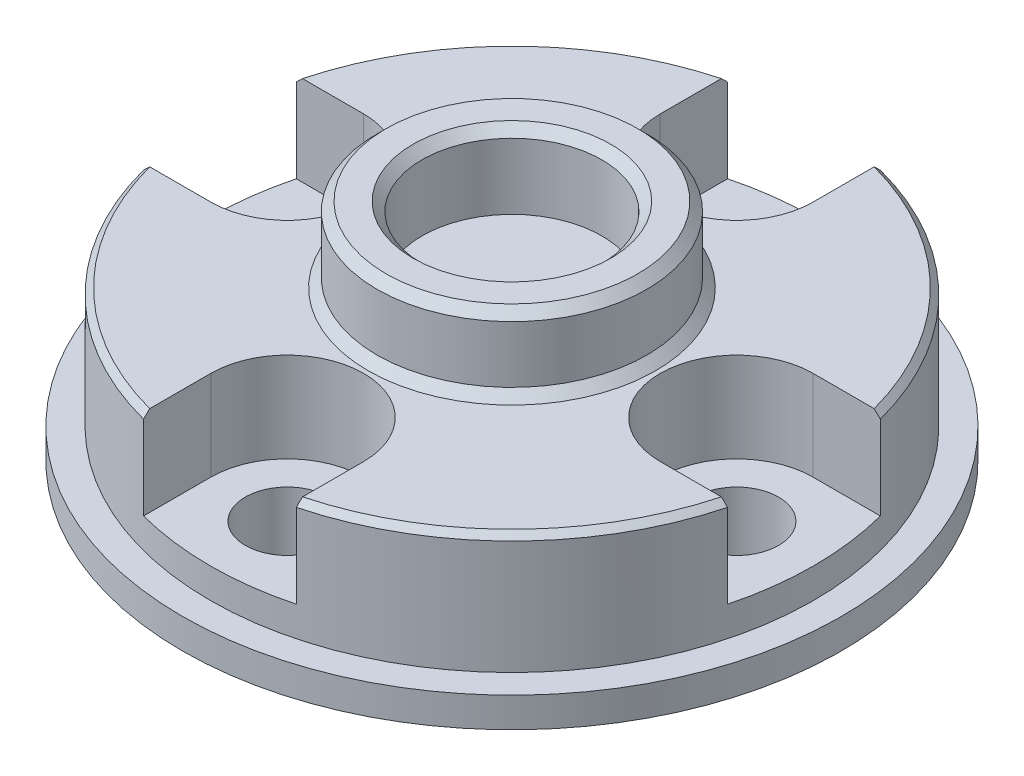
ISO-10303-21;
HEADER;
FILE_DESCRIPTION(('STEP AP214'),'2;1');
FILE_NAME('part.step','',(''),(''),'','','');
FILE_SCHEMA(('AUTOMOTIVE_DESIGN { 1 0 10303 214 1 1 1 1 }'));
ENDSEC;
DATA;
#1=APPLICATION_CONTEXT('core data for automotive mechanical design processes');
#2=APPLICATION_PROTOCOL_DEFINITION('international standard','automotive_design',2000,#1);
#3=PRODUCT_CONTEXT('',#1,'mechanical');
#4=PRODUCT('Part','Part','',(#3));
#5=PRODUCT_RELATED_PRODUCT_CATEGORY('part','',(#4));
#6=PRODUCT_DEFINITION_FORMATION('','',#4);
#7=PRODUCT_DEFINITION_CONTEXT('part definition',#1,'design');
#8=PRODUCT_DEFINITION('design','',#6,#7);
#9=PRODUCT_DEFINITION_SHAPE('','',#8);
#10=(LENGTH_UNIT() NAMED_UNIT(*) SI_UNIT(.MILLI.,.METRE.));
#11=(NAMED_UNIT(*) PLANE_ANGLE_UNIT() SI_UNIT($,.RADIAN.));
#12=(NAMED_UNIT(*) SI_UNIT($,.STERADIAN.) SOLID_ANGLE_UNIT());
#13=UNCERTAINTY_MEASURE_WITH_UNIT(LENGTH_MEASURE(1.E-05),#10,'distance_accuracy_value','');
#14=(GEOMETRIC_REPRESENTATION_CONTEXT(3) GLOBAL_UNCERTAINTY_ASSIGNED_CONTEXT((#13)) GLOBAL_UNIT_ASSIGNED_CONTEXT((#10,
#11,#12)) REPRESENTATION_CONTEXT('',''));
#15=CARTESIAN_POINT('',(0.,0.,0.));
#16=DIRECTION('',(0.,0.,1.));
#17=DIRECTION('',(1.,0.,0.));
#18=AXIS2_PLACEMENT_3D('',#15,#16,#17);
#19=CARTESIAN_POINT('',(0.,5.,0.));
#20=DIRECTION('',(0.,-1.,0.));
#21=DIRECTION('',(0.,0.,-1.));
#22=AXIS2_PLACEMENT_3D('',#19,#20,#21);
#23=CONICAL_SURFACE('',#22,9.87499999999999,0.785398163397457);
#24=CARTESIAN_POINT('',(-2.55,2.60412662835261,-12.0029926811194));
#25=CARTESIAN_POINT('',(-2.55,2.99459332859695,-11.6037550028997));
#26=CARTESIAN_POINT('',(-2.55,3.38468482583529,-11.2041482804221));
#27=CARTESIAN_POINT('',(-2.55,4.16367329476818,-10.4037878109222));
#28=CARTESIAN_POINT('',(-2.55,4.55257028959464,-10.0030340864061));
#29=CARTESIAN_POINT('',(-2.55,5.3287457275203,-9.19995014030859));
#30=CARTESIAN_POINT('',(-2.55,5.71602415037439,-8.79761989912932));
#31=CARTESIAN_POINT('',(-2.55,6.29512881283507,-8.19238170324087));
#32=CARTESIAN_POINT('',(-2.55,6.48786340072538,-7.99034319562881));
#33=CARTESIAN_POINT('',(-2.55,6.87256618016411,-7.58553618638512));
#34=CARTESIAN_POINT('',(-2.55,7.06453436802406,-7.38276768124913));
#35=CARTESIAN_POINT('',(-2.55,7.25603802851124,-7.17955998115422));
#36=B_SPLINE_CURVE_WITH_KNOTS('',3,(#24,#25,#26,#27,#28,#29,#30,#31,#32,#33,#34,#35),
.UNSPECIFIED.,.F.,.F.,(4,2,2,2,2,4),(0.,1.6753211641718,3.3506096780616,5.02591908413256,
5.86359005247663,6.70126504744079),.UNSPECIFIED.);
#37=CARTESIAN_POINT('',(-2.55,4.79999999999999,-9.74695465260817));
#38=VERTEX_POINT('',#37);
#39=CARTESIAN_POINT('',(-2.55,5.,-9.54007992628992));
#40=VERTEX_POINT('',#39);
#41=EDGE_CURVE('E460',#38,#40,#36,.T.);
#42=ORIENTED_EDGE('',*,*,#41,.F.);
#43=CARTESIAN_POINT('',(0.,4.8,0.));
#44=DIRECTION('',(0.,1.,0.));
#45=DIRECTION('',(0.,0.,1.));
#46=AXIS2_PLACEMENT_3D('',#43,#44,#45);
#47=CIRCLE('',#46,10.075);
#48=CARTESIAN_POINT('',(-9.74695465260816,4.80000000000001,-2.55));
#49=VERTEX_POINT('',#48);
#50=EDGE_CURVE('E319',#49,#38,#47,.F.);
#51=ORIENTED_EDGE('',*,*,#50,.F.);
#52=CARTESIAN_POINT('',(-7.17955998115423,7.25603802851124,-2.55));
#53=CARTESIAN_POINT('',(-7.38276768124914,7.06453436802406,-2.55));
#54=CARTESIAN_POINT('',(-7.58553618638513,6.8725661801641,-2.55));
#55=CARTESIAN_POINT('',(-7.99034319562882,6.48786340072538,-2.55));
#56=CARTESIAN_POINT('',(-8.19238170324088,6.29512881283507,-2.55));
#57=CARTESIAN_POINT('',(-8.79761989912932,5.71602415037439,-2.55));
#58=CARTESIAN_POINT('',(-9.1999501403086,5.32874572752029,-2.55));
#59=CARTESIAN_POINT('',(-10.0030340864061,4.55257028959464,-2.55));
#60=CARTESIAN_POINT('',(-10.4037878109222,4.16367329476818,-2.55));
#61=CARTESIAN_POINT('',(-11.2041482804221,3.38468482583529,-2.54999999999999));
#62=CARTESIAN_POINT('',(-11.6037550028997,2.99459332859696,-2.54999999999999));
#63=CARTESIAN_POINT('',(-12.0029926811194,2.60412662835262,-2.54999999999999));
#64=B_SPLINE_CURVE_WITH_KNOTS('',3,(#52,#53,#54,#55,#56,#57,#58,#59,#60,#61,#62,#63),
.UNSPECIFIED.,.F.,.F.,(4,2,2,2,2,4),(0.,0.837674994964157,1.67534596330823,3.35065536937918,
5.02594388326898,6.70126504744077),.UNSPECIFIED.);
#65=CARTESIAN_POINT('',(-9.54007992628992,5.,-2.55));
#66=VERTEX_POINT('',#65);
#67=EDGE_CURVE('E318',#66,#49,#64,.T.);
#68=ORIENTED_EDGE('',*,*,#67,.F.);
#69=CARTESIAN_POINT('',(0.,5.,0.));
#70=DIRECTION('',(0.,1.,0.));
#71=DIRECTION('',(0.,0.,1.));
#72=AXIS2_PLACEMENT_3D('',#69,#70,#71);
#73=CIRCLE('',#72,9.87499999999999);
#74=EDGE_CURVE('E461',#40,#66,#73,.T.);
#75=ORIENTED_EDGE('',*,*,#74,.F.);
#76=EDGE_LOOP('',(#42,#51,#68,#75));
#77=FACE_BOUND('',#76,.T.);
#78=ADVANCED_FACE('F35',(#77),#23,.T.);
#79=CARTESIAN_POINT('',(2.55,7.25603802851124,-7.17955998115422));
#80=CARTESIAN_POINT('',(2.55,7.06453436802406,-7.38276768124913));
#81=CARTESIAN_POINT('',(2.55,6.8725661801641,-7.58553618638512));
#82=CARTESIAN_POINT('',(2.55,6.48786340072538,-7.99034319562882));
#83=CARTESIAN_POINT('',(2.55,6.29512881283507,-8.19238170324088));
#84=CARTESIAN_POINT('',(2.55,5.71602415037438,-8.79761989912932));
#85=CARTESIAN_POINT('',(2.55,5.32874572752029,-9.1999501403086));
#86=CARTESIAN_POINT('',(2.55,4.55257028959463,-10.0030340864061));
#87=CARTESIAN_POINT('',(2.55,4.16367329476818,-10.4037878109222));
#88=CARTESIAN_POINT('',(2.55,3.38468482583529,-11.2041482804221));
#89=CARTESIAN_POINT('',(2.55,2.99459332859695,-11.6037550028997));
#90=CARTESIAN_POINT('',(2.55,2.60412662835261,-12.0029926811194));
#91=B_SPLINE_CURVE_WITH_KNOTS('',3,(#79,#80,#81,#82,#83,#84,#85,#86,#87,#88,#89,#90),
.UNSPECIFIED.,.F.,.F.,(4,2,2,2,2,4),(0.,0.837674994964159,1.67534596330824,3.35065536937919,
5.02594388326899,6.70126504744079),.UNSPECIFIED.);
#92=CARTESIAN_POINT('',(2.55,5.,-9.54007992628992));
#93=VERTEX_POINT('',#92);
#94=CARTESIAN_POINT('',(2.55,4.8,-9.74695465260817));
#95=VERTEX_POINT('',#94);
#96=EDGE_CURVE('E464',#93,#95,#91,.T.);
#97=ORIENTED_EDGE('',*,*,#96,.F.);
#98=CARTESIAN_POINT('',(9.54007992628992,5.,-2.55));
#99=VERTEX_POINT('',#98);
#100=EDGE_CURVE('E198',#99,#93,#73,.T.);
#101=ORIENTED_EDGE('',*,*,#100,.F.);
#102=CARTESIAN_POINT('',(12.0029926811194,2.60412662835261,-2.55));
#103=CARTESIAN_POINT('',(11.6037550028997,2.99459332859695,-2.55));
#104=CARTESIAN_POINT('',(11.2041482804221,3.38468482583529,-2.55));
#105=CARTESIAN_POINT('',(10.4037878109222,4.16367329476818,-2.55));
#106=CARTESIAN_POINT('',(10.0030340864061,4.55257028959464,-2.55));
#107=CARTESIAN_POINT('',(9.19995014030859,5.3287457275203,-2.55));
#108=CARTESIAN_POINT('',(8.79761989912932,5.71602415037439,-2.55));
#109=CARTESIAN_POINT('',(8.19238170324087,6.29512881283507,-2.55));
#110=CARTESIAN_POINT('',(7.99034319562881,6.48786340072538,-2.55));
#111=CARTESIAN_POINT('',(7.58553618638512,6.87256618016411,-2.55));
#112=CARTESIAN_POINT('',(7.38276768124913,7.06453436802406,-2.55));
#113=CARTESIAN_POINT('',(7.17955998115422,7.25603802851124,-2.55));
#114=B_SPLINE_CURVE_WITH_KNOTS('',3,(#102,#103,#104,#105,#106,#107,#108,#109,#110,#111,#112,
#113),.UNSPECIFIED.,.F.,.F.,(4,2,2,2,2,4),(0.,1.6753211641718,3.3506096780616,5.02591908413256,
5.86359005247663,6.70126504744079),.UNSPECIFIED.);
#115=CARTESIAN_POINT('',(9.74695465260817,4.8,-2.55));
#116=VERTEX_POINT('',#115);
#117=EDGE_CURVE('E426',#116,#99,#114,.T.);
#118=ORIENTED_EDGE('',*,*,#117,.F.);
#119=EDGE_CURVE('E451',#95,#116,#47,.F.);
#120=ORIENTED_EDGE('',*,*,#119,.F.);
#121=EDGE_LOOP('',(#97,#101,#118,#120));
#122=FACE_BOUND('',#121,.T.);
#123=ADVANCED_FACE('F400',(#122),#23,.T.);
#124=CARTESIAN_POINT('',(7.17955998115422,7.25603802851124,2.55));
#125=CARTESIAN_POINT('',(7.38276768124913,7.06453436802406,2.55));
#126=CARTESIAN_POINT('',(7.58553618638512,6.87256618016411,2.55));
#127=CARTESIAN_POINT('',(7.99034319562881,6.48786340072538,2.55));
#128=CARTESIAN_POINT('',(8.19238170324087,6.29512881283507,2.55));
#129=CARTESIAN_POINT('',(8.79761989912932,5.71602415037438,2.55));
#130=CARTESIAN_POINT('',(9.1999501403086,5.32874572752029,2.55));
#131=CARTESIAN_POINT('',(10.0030340864061,4.55257028959463,2.55));
#132=CARTESIAN_POINT('',(10.4037878109222,4.16367329476817,2.55));
#133=CARTESIAN_POINT('',(11.2041482804221,3.38468482583529,2.55));
#134=CARTESIAN_POINT('',(11.6037550028997,2.99459332859695,2.55));
#135=CARTESIAN_POINT('',(12.0029926811194,2.6041266283526,2.55));
#136=B_SPLINE_CURVE_WITH_KNOTS('',3,(#124,#125,#126,#127,#128,#129,#130,#131,#132,#133,#134,
#135),.UNSPECIFIED.,.F.,.F.,(4,2,2,2,2,4),(0.,0.837674994964161,1.67534596330824,
3.3506553693792,5.025943883269,6.7012650474408),.UNSPECIFIED.);
#137=CARTESIAN_POINT('',(9.54007992628992,5.,2.55));
#138=VERTEX_POINT('',#137);
#139=CARTESIAN_POINT('',(9.74695465260817,4.8,2.55));
#140=VERTEX_POINT('',#139);
#141=EDGE_CURVE('E422',#138,#140,#136,.T.);
#142=ORIENTED_EDGE('',*,*,#141,.F.);
#143=CARTESIAN_POINT('',(2.55,5.,9.54007992628992));
#144=VERTEX_POINT('',#143);
#145=EDGE_CURVE('E311',#144,#138,#73,.T.);
#146=ORIENTED_EDGE('',*,*,#145,.F.);
#147=CARTESIAN_POINT('',(2.55,2.6041266283526,12.0029926811194));
#148=CARTESIAN_POINT('',(2.55,2.99459332859695,11.6037550028997));
#149=CARTESIAN_POINT('',(2.55,3.38468482583529,11.2041482804221));
#150=CARTESIAN_POINT('',(2.55,4.16367329476818,10.4037878109222));
#151=CARTESIAN_POINT('',(2.55,4.55257028959463,10.0030340864061));
#152=CARTESIAN_POINT('',(2.55,5.32874572752029,9.1999501403086));
#153=CARTESIAN_POINT('',(2.55,5.71602415037438,8.79761989912932));
#154=CARTESIAN_POINT('',(2.55,6.29512881283507,8.19238170324088));
#155=CARTESIAN_POINT('',(2.55,6.48786340072538,7.99034319562882));
#156=CARTESIAN_POINT('',(2.55,6.8725661801641,7.58553618638512));
#157=CARTESIAN_POINT('',(2.55,7.06453436802406,7.38276768124913));
#158=CARTESIAN_POINT('',(2.55,7.25603802851124,7.17955998115422));
#159=B_SPLINE_CURVE_WITH_KNOTS('',3,(#147,#148,#149,#150,#151,#152,#153,#154,#155,#156,#157,
#158),.UNSPECIFIED.,.F.,.F.,(4,2,2,2,2,4),(0.,1.6753211641718,3.3506096780616,5.02591908413255,
5.86359005247663,6.70126504744079),.UNSPECIFIED.);
#160=CARTESIAN_POINT('',(2.55,4.80000000000001,9.74695465260817));
#161=VERTEX_POINT('',#160);
#162=EDGE_CURVE('E427',#161,#144,#159,.T.);
#163=ORIENTED_EDGE('',*,*,#162,.F.);
#164=EDGE_CURVE('E314',#140,#161,#47,.F.);
#165=ORIENTED_EDGE('',*,*,#164,.F.);
#166=EDGE_LOOP('',(#142,#146,#163,#165));
#167=FACE_BOUND('',#166,.T.);
#168=ADVANCED_FACE('F377',(#167),#23,.T.);
#169=CARTESIAN_POINT('',(-7.5,0.,0.));
#170=DIRECTION('',(0.,1.,0.));
#171=DIRECTION('',(0.,0.,1.));
#172=AXIS2_PLACEMENT_3D('',#169,#170,#171);
#173=CYLINDRICAL_SURFACE('',#172,1.4);
#174=CARTESIAN_POINT('',(-7.5,0.,0.));
#175=DIRECTION('',(0.,1.,0.));
#176=DIRECTION('',(0.,0.,1.));
#177=AXIS2_PLACEMENT_3D('',#174,#175,#176);
#178=CIRCLE('',#177,1.4);
#179=CARTESIAN_POINT('',(-7.5,0.,1.4));
#180=VERTEX_POINT('',#179);
#181=EDGE_CURVE('E298',#180,#180,#178,.T.);
#182=ORIENTED_EDGE('',*,*,#181,.F.);
#183=EDGE_LOOP('',(#182));
#184=FACE_BOUND('',#183,.T.);
#185=CARTESIAN_POINT('',(-7.5,2.,0.));
#186=DIRECTION('',(0.,1.,0.));
#187=DIRECTION('',(0.,0.,1.));
#188=AXIS2_PLACEMENT_3D('',#185,#186,#187);
#189=CIRCLE('',#188,1.4);
#190=CARTESIAN_POINT('',(-7.5,2.,1.4));
#191=VERTEX_POINT('',#190);
#192=EDGE_CURVE('E301',#191,#191,#189,.F.);
#193=ORIENTED_EDGE('',*,*,#192,.F.);
#194=EDGE_LOOP('',(#193));
#195=FACE_BOUND('',#194,.T.);
#196=ADVANCED_FACE('F373',(#184,#195),#173,.F.);
#197=CARTESIAN_POINT('',(0.,0.,7.5));
#198=DIRECTION('',(0.,1.,0.));
#199=DIRECTION('',(0.,0.,1.));
#200=AXIS2_PLACEMENT_3D('',#197,#198,#199);
#201=CYLINDRICAL_SURFACE('',#200,1.4);
#202=CARTESIAN_POINT('',(0.,0.,7.5));
#203=DIRECTION('',(0.,1.,0.));
#204=DIRECTION('',(0.,0.,1.));
#205=AXIS2_PLACEMENT_3D('',#202,#203,#204);
#206=CIRCLE('',#205,1.4);
#207=CARTESIAN_POINT('',(0.,0.,8.9));
#208=VERTEX_POINT('',#207);
#209=EDGE_CURVE('E295',#208,#208,#206,.T.);
#210=ORIENTED_EDGE('',*,*,#209,.F.);
#211=EDGE_LOOP('',(#210));
#212=FACE_BOUND('',#211,.T.);
#213=CARTESIAN_POINT('',(0.,2.,7.5));
#214=DIRECTION('',(0.,1.,0.));
#215=DIRECTION('',(0.,0.,1.));
#216=AXIS2_PLACEMENT_3D('',#213,#214,#215);
#217=CIRCLE('',#216,1.4);
#218=CARTESIAN_POINT('',(0.,2.,8.9));
#219=VERTEX_POINT('',#218);
#220=EDGE_CURVE('E325',#219,#219,#217,.F.);
#221=ORIENTED_EDGE('',*,*,#220,.F.);
#222=EDGE_LOOP('',(#221));
#223=FACE_BOUND('',#222,.T.);
#224=ADVANCED_FACE('F369',(#212,#223),#201,.F.);
#225=CARTESIAN_POINT('',(7.5,0.,0.));
#226=DIRECTION('',(0.,1.,0.));
#227=DIRECTION('',(0.,0.,1.));
#228=AXIS2_PLACEMENT_3D('',#225,#226,#227);
#229=CYLINDRICAL_SURFACE('',#228,1.4);
#230=CARTESIAN_POINT('',(7.5,0.,0.));
#231=DIRECTION('',(0.,1.,0.));
#232=DIRECTION('',(0.,0.,1.));
#233=AXIS2_PLACEMENT_3D('',#230,#231,#232);
#234=CIRCLE('',#233,1.4);
#235=CARTESIAN_POINT('',(7.5,0.,1.4));
#236=VERTEX_POINT('',#235);
#237=EDGE_CURVE('E292',#236,#236,#234,.T.);
#238=ORIENTED_EDGE('',*,*,#237,.F.);
#239=EDGE_LOOP('',(#238));
#240=FACE_BOUND('',#239,.T.);
#241=CARTESIAN_POINT('',(7.5,2.,0.));
#242=DIRECTION('',(0.,1.,0.));
#243=DIRECTION('',(0.,0.,1.));
#244=AXIS2_PLACEMENT_3D('',#241,#242,#243);
#245=CIRCLE('',#244,1.4);
#246=CARTESIAN_POINT('',(7.5,2.,1.4));
#247=VERTEX_POINT('',#246);
#248=EDGE_CURVE('E322',#247,#247,#245,.F.);
#249=ORIENTED_EDGE('',*,*,#248,.F.);
#250=EDGE_LOOP('',(#249));
#251=FACE_BOUND('',#250,.T.);
#252=ADVANCED_FACE('F365',(#240,#251),#229,.F.);
#253=CARTESIAN_POINT('',(0.,0.,-7.5));
#254=DIRECTION('',(0.,1.,0.));
#255=DIRECTION('',(0.,0.,1.));
#256=AXIS2_PLACEMENT_3D('',#253,#254,#255);
#257=CYLINDRICAL_SURFACE('',#256,1.4);
#258=CARTESIAN_POINT('',(0.,0.,-7.5));
#259=DIRECTION('',(0.,1.,0.));
#260=DIRECTION('',(0.,0.,1.));
#261=AXIS2_PLACEMENT_3D('',#258,#259,#260);
#262=CIRCLE('',#261,1.4);
#263=CARTESIAN_POINT('',(0.,0.,-6.1));
#264=VERTEX_POINT('',#263);
#265=EDGE_CURVE('E288',#264,#264,#262,.T.);
#266=ORIENTED_EDGE('',*,*,#265,.F.);
#267=EDGE_LOOP('',(#266));
#268=FACE_BOUND('',#267,.T.);
#269=CARTESIAN_POINT('',(0.,2.,-7.5));
#270=DIRECTION('',(0.,1.,0.));
#271=DIRECTION('',(0.,0.,1.));
#272=AXIS2_PLACEMENT_3D('',#269,#270,#271);
#273=CIRCLE('',#272,1.4);
#274=CARTESIAN_POINT('',(0.,2.,-6.1));
#275=VERTEX_POINT('',#274);
#276=EDGE_CURVE('E210',#275,#275,#273,.F.);
#277=ORIENTED_EDGE('',*,*,#276,.F.);
#278=EDGE_LOOP('',(#277));
#279=FACE_BOUND('',#278,.T.);
#280=ADVANCED_FACE('F361',(#268,#279),#257,.F.);
#281=CARTESIAN_POINT('',(0.,1.,0.));
#282=DIRECTION('',(0.,-1.,0.));
#283=DIRECTION('',(0.,0.,-1.));
#284=AXIS2_PLACEMENT_3D('',#281,#282,#283);
#285=CYLINDRICAL_SURFACE('',#284,11.);
#286=CARTESIAN_POINT('',(0.,1.,0.));
#287=DIRECTION('',(0.,1.,0.));
#288=DIRECTION('',(0.,0.,1.));
#289=AXIS2_PLACEMENT_3D('',#286,#287,#288);
#290=CIRCLE('',#289,11.);
#291=CARTESIAN_POINT('',(0.,1.,11.));
#292=VERTEX_POINT('',#291);
#293=EDGE_CURVE('E306',#292,#292,#290,.T.);
#294=ORIENTED_EDGE('',*,*,#293,.F.);
#295=EDGE_LOOP('',(#294));
#296=FACE_BOUND('',#295,.T.);
#297=CARTESIAN_POINT('',(0.,0.,0.));
#298=DIRECTION('',(0.,1.,0.));
#299=DIRECTION('',(0.,0.,1.));
#300=AXIS2_PLACEMENT_3D('',#297,#298,#299);
#301=CIRCLE('',#300,11.);
#302=CARTESIAN_POINT('',(0.,0.,11.));
#303=VERTEX_POINT('',#302);
#304=EDGE_CURVE('E291',#303,#303,#301,.T.);
#305=ORIENTED_EDGE('',*,*,#304,.T.);
#306=EDGE_LOOP('',(#305));
#307=FACE_BOUND('',#306,.T.);
#308=ADVANCED_FACE('F364',(#296,#307),#285,.T.);
#309=CARTESIAN_POINT('',(0.,1.,0.));
#310=DIRECTION('',(0.,1.,0.));
#311=DIRECTION('',(0.,0.,1.));
#312=AXIS2_PLACEMENT_3D('',#309,#310,#311);
#313=PLANE('',#312);
#314=CARTESIAN_POINT('',(0.,1.,0.));
#315=DIRECTION('',(0.,1.,0.));
#316=DIRECTION('',(0.,0.,1.));
#317=AXIS2_PLACEMENT_3D('',#314,#315,#316);
#318=CIRCLE('',#317,10.075);
#319=CARTESIAN_POINT('',(0.,1.,10.075));
#320=VERTEX_POINT('',#319);
#321=EDGE_CURVE('E302',#320,#320,#318,.T.);
#322=ORIENTED_EDGE('',*,*,#321,.F.);
#323=EDGE_LOOP('',(#322));
#324=FACE_BOUND('',#323,.T.);
#325=ORIENTED_EDGE('',*,*,#293,.T.);
#326=EDGE_LOOP('',(#325));
#327=FACE_BOUND('',#326,.T.);
#328=ADVANCED_FACE('F387',(#324,#327),#313,.T.);
#329=CARTESIAN_POINT('',(0.,0.,0.));
#330=DIRECTION('',(0.,1.,0.));
#331=DIRECTION('',(0.,0.,1.));
#332=AXIS2_PLACEMENT_3D('',#329,#330,#331);
#333=PLANE('',#332);
#334=ORIENTED_EDGE('',*,*,#265,.T.);
#335=EDGE_LOOP('',(#334));
#336=FACE_BOUND('',#335,.T.);
#337=ORIENTED_EDGE('',*,*,#237,.T.);
#338=EDGE_LOOP('',(#337));
#339=FACE_BOUND('',#338,.T.);
#340=ORIENTED_EDGE('',*,*,#209,.T.);
#341=EDGE_LOOP('',(#340));
#342=FACE_BOUND('',#341,.T.);
#343=ORIENTED_EDGE('',*,*,#181,.T.);
#344=EDGE_LOOP('',(#343));
#345=FACE_BOUND('',#344,.T.);
#346=ORIENTED_EDGE('',*,*,#304,.F.);
#347=EDGE_LOOP('',(#346));
#348=FACE_BOUND('',#347,.T.);
#349=ADVANCED_FACE('F385',(#336,#339,#342,#345,#348),#333,.F.);
#350=CARTESIAN_POINT('',(0.,5.,0.));
#351=DIRECTION('',(0.,-1.,0.));
#352=DIRECTION('',(0.,0.,-1.));
#353=AXIS2_PLACEMENT_3D('',#350,#351,#352);
#354=CYLINDRICAL_SURFACE('',#353,10.075);
#355=ORIENTED_EDGE('',*,*,#50,.T.);
#356=DIRECTION('',(0.,1.,0.));
#357=VECTOR('',#356,1.);
#358=CARTESIAN_POINT('',(-2.55,-7.2301884484431,-9.74695465260817));
#359=LINE('',#358,#357);
#360=CARTESIAN_POINT('',(-2.55,2.,-9.74695465260817));
#361=VERTEX_POINT('',#360);
#362=EDGE_CURVE('E205',#361,#38,#359,.T.);
#363=ORIENTED_EDGE('',*,*,#362,.F.);
#364=CARTESIAN_POINT('',(0.,2.,0.));
#365=DIRECTION('',(0.,1.,0.));
#366=DIRECTION('',(0.,0.,1.));
#367=AXIS2_PLACEMENT_3D('',#364,#365,#366);
#368=CIRCLE('',#367,10.075);
#369=CARTESIAN_POINT('',(2.55,2.,-9.74695465260817));
#370=VERTEX_POINT('',#369);
#371=EDGE_CURVE('E204',#361,#370,#368,.F.);
#372=ORIENTED_EDGE('',*,*,#371,.T.);
#373=DIRECTION('',(0.,1.,0.));
#374=VECTOR('',#373,1.);
#375=CARTESIAN_POINT('',(2.55,-7.2301884484431,-9.74695465260817));
#376=LINE('',#375,#374);
#377=EDGE_CURVE('E181',#370,#95,#376,.T.);
#378=ORIENTED_EDGE('',*,*,#377,.T.);
#379=ORIENTED_EDGE('',*,*,#119,.T.);
#380=DIRECTION('',(0.,1.,0.));
#381=VECTOR('',#380,1.);
#382=CARTESIAN_POINT('',(9.74695465260817,-7.2301884484431,-2.55));
#383=LINE('',#382,#381);
#384=CARTESIAN_POINT('',(9.74695465260816,2.,-2.55));
#385=VERTEX_POINT('',#384);
#386=EDGE_CURVE('E231',#385,#116,#383,.T.);
#387=ORIENTED_EDGE('',*,*,#386,.F.);
#388=CARTESIAN_POINT('',(0.,2.,0.));
#389=DIRECTION('',(0.,1.,0.));
#390=DIRECTION('',(0.,0.,1.));
#391=AXIS2_PLACEMENT_3D('',#388,#389,#390);
#392=CIRCLE('',#391,10.075);
#393=CARTESIAN_POINT('',(9.74695465260817,2.,2.55));
#394=VERTEX_POINT('',#393);
#395=EDGE_CURVE('E212',#385,#394,#392,.F.);
#396=ORIENTED_EDGE('',*,*,#395,.T.);
#397=DIRECTION('',(0.,1.,0.));
#398=VECTOR('',#397,1.);
#399=CARTESIAN_POINT('',(9.74695465260817,-7.2301884484431,2.55));
#400=LINE('',#399,#398);
#401=EDGE_CURVE('E233',#394,#140,#400,.T.);
#402=ORIENTED_EDGE('',*,*,#401,.T.);
#403=ORIENTED_EDGE('',*,*,#164,.T.);
#404=DIRECTION('',(0.,1.,0.));
#405=VECTOR('',#404,1.);
#406=CARTESIAN_POINT('',(2.55,-7.2301884484431,9.74695465260817));
#407=LINE('',#406,#405);
#408=CARTESIAN_POINT('',(2.55,2.,9.74695465260817));
#409=VERTEX_POINT('',#408);
#410=EDGE_CURVE('E256',#409,#161,#407,.T.);
#411=ORIENTED_EDGE('',*,*,#410,.F.);
#412=CARTESIAN_POINT('',(0.,2.,0.));
#413=DIRECTION('',(0.,1.,0.));
#414=DIRECTION('',(0.,0.,1.));
#415=AXIS2_PLACEMENT_3D('',#412,#413,#414);
#416=CIRCLE('',#415,10.075);
#417=CARTESIAN_POINT('',(-2.54999999999999,2.,9.74695465260817));
#418=VERTEX_POINT('',#417);
#419=EDGE_CURVE('E238',#409,#418,#416,.F.);
#420=ORIENTED_EDGE('',*,*,#419,.T.);
#421=DIRECTION('',(0.,1.,0.));
#422=VECTOR('',#421,1.);
#423=CARTESIAN_POINT('',(-2.54999999999999,-7.2301884484431,9.74695465260817));
#424=LINE('',#423,#422);
#425=CARTESIAN_POINT('',(-2.54999999999999,4.8,9.74695465260817));
#426=VERTEX_POINT('',#425);
#427=EDGE_CURVE('E258',#418,#426,#424,.T.);
#428=ORIENTED_EDGE('',*,*,#427,.T.);
#429=CARTESIAN_POINT('',(-9.74695465260817,4.8,2.55));
#430=VERTEX_POINT('',#429);
#431=EDGE_CURVE('E315',#426,#430,#47,.F.);
#432=ORIENTED_EDGE('',*,*,#431,.T.);
#433=DIRECTION('',(0.,1.,0.));
#434=VECTOR('',#433,1.);
#435=CARTESIAN_POINT('',(-9.74695465260817,-7.2301884484431,2.55));
#436=LINE('',#435,#434);
#437=CARTESIAN_POINT('',(-9.74695465260817,2.,2.55));
#438=VERTEX_POINT('',#437);
#439=EDGE_CURVE('E281',#438,#430,#436,.T.);
#440=ORIENTED_EDGE('',*,*,#439,.F.);
#441=CARTESIAN_POINT('',(0.,2.,0.));
#442=DIRECTION('',(0.,1.,0.));
#443=DIRECTION('',(0.,0.,1.));
#444=AXIS2_PLACEMENT_3D('',#441,#442,#443);
#445=CIRCLE('',#444,10.075);
#446=CARTESIAN_POINT('',(-9.74695465260816,2.,-2.55));
#447=VERTEX_POINT('',#446);
#448=EDGE_CURVE('E263',#438,#447,#445,.F.);
#449=ORIENTED_EDGE('',*,*,#448,.T.);
#450=DIRECTION('',(0.,1.,0.));
#451=VECTOR('',#450,1.);
#452=CARTESIAN_POINT('',(-9.74695465260816,-7.2301884484431,-2.55));
#453=LINE('',#452,#451);
#454=EDGE_CURVE('E283',#447,#49,#453,.T.);
#455=ORIENTED_EDGE('',*,*,#454,.T.);
#456=EDGE_LOOP('',(#355,#363,#372,#378,#379,#387,#396,#402,#403,#411,#420,#428,#432,#440,#449,#455));
#457=FACE_BOUND('',#456,.T.);
#458=ORIENTED_EDGE('',*,*,#321,.T.);
#459=EDGE_LOOP('',(#458));
#460=FACE_BOUND('',#459,.T.);
#461=ADVANCED_FACE('F381',(#457,#460),#354,.T.);
#462=CARTESIAN_POINT('',(0.,5.,0.));
#463=DIRECTION('',(0.,1.,0.));
#464=DIRECTION('',(0.,0.,1.));
#465=AXIS2_PLACEMENT_3D('',#462,#463,#464);
#466=PLANE('',#465);
#467=CARTESIAN_POINT('',(0.,5.,0.));
#468=DIRECTION('',(0.,1.,0.));
#469=DIRECTION('',(0.,0.,1.));
#470=AXIS2_PLACEMENT_3D('',#467,#468,#469);
#471=CIRCLE('',#470,4.8);
#472=CARTESIAN_POINT('',(0.,5.,4.8));
#473=VERTEX_POINT('',#472);
#474=EDGE_CURVE('E813',#473,#473,#471,.F.);
#475=ORIENTED_EDGE('',*,*,#474,.T.);
#476=EDGE_LOOP('',(#475));
#477=FACE_BOUND('',#476,.T.);
#478=DIRECTION('',(0.,0.,1.));
#479=VECTOR('',#478,1.);
#480=CARTESIAN_POINT('',(-2.55,5.,-7.5));
#481=LINE('',#480,#479);
#482=CARTESIAN_POINT('',(-2.55,5.,-7.5));
#483=VERTEX_POINT('',#482);
#484=EDGE_CURVE('E182',#40,#483,#481,.T.);
#485=ORIENTED_EDGE('',*,*,#484,.F.);
#486=ORIENTED_EDGE('',*,*,#74,.T.);
#487=DIRECTION('',(-1.,0.,0.));
#488=VECTOR('',#487,1.);
#489=CARTESIAN_POINT('',(-7.5,5.,-2.55));
#490=LINE('',#489,#488);
#491=CARTESIAN_POINT('',(-7.5,5.,-2.55));
#492=VERTEX_POINT('',#491);
#493=EDGE_CURVE('E58',#492,#66,#490,.T.);
#494=ORIENTED_EDGE('',*,*,#493,.F.);
#495=CARTESIAN_POINT('',(-7.5,5.,0.));
#496=DIRECTION('',(0.,1.,0.));
#497=DIRECTION('',(0.,0.,1.));
#498=AXIS2_PLACEMENT_3D('',#495,#496,#497);
#499=CIRCLE('',#498,2.55);
#500=CARTESIAN_POINT('',(-7.5,5.,2.55));
#501=VERTEX_POINT('',#500);
#502=EDGE_CURVE('E271',#501,#492,#499,.T.);
#503=ORIENTED_EDGE('',*,*,#502,.F.);
#504=DIRECTION('',(1.,0.,0.));
#505=VECTOR('',#504,1.);
#506=CARTESIAN_POINT('',(-7.5,5.,2.55));
#507=LINE('',#506,#505);
#508=CARTESIAN_POINT('',(-9.54007992628992,5.,2.55));
#509=VERTEX_POINT('',#508);
#510=EDGE_CURVE('E276',#509,#501,#507,.T.);
#511=ORIENTED_EDGE('',*,*,#510,.F.);
#512=CARTESIAN_POINT('',(-2.55,5.,9.54007992628992));
#513=VERTEX_POINT('',#512);
#514=EDGE_CURVE('E305',#509,#513,#73,.T.);
#515=ORIENTED_EDGE('',*,*,#514,.T.);
#516=DIRECTION('',(0.,0.,1.));
#517=VECTOR('',#516,1.);
#518=CARTESIAN_POINT('',(-2.55,5.,7.5));
#519=LINE('',#518,#517);
#520=CARTESIAN_POINT('',(-2.55,5.,7.5));
#521=VERTEX_POINT('',#520);
#522=EDGE_CURVE('E50',#521,#513,#519,.T.);
#523=ORIENTED_EDGE('',*,*,#522,.F.);
#524=CARTESIAN_POINT('',(0.,5.,7.5));
#525=DIRECTION('',(0.,1.,0.));
#526=DIRECTION('',(0.,0.,1.));
#527=AXIS2_PLACEMENT_3D('',#524,#525,#526);
#528=CIRCLE('',#527,2.55);
#529=CARTESIAN_POINT('',(2.55,5.,7.5));
#530=VERTEX_POINT('',#529);
#531=EDGE_CURVE('E246',#530,#521,#528,.T.);
#532=ORIENTED_EDGE('',*,*,#531,.F.);
#533=DIRECTION('',(0.,0.,-1.));
#534=VECTOR('',#533,1.);
#535=CARTESIAN_POINT('',(2.55,5.,7.5));
#536=LINE('',#535,#534);
#537=EDGE_CURVE('E251',#144,#530,#536,.T.);
#538=ORIENTED_EDGE('',*,*,#537,.F.);
#539=ORIENTED_EDGE('',*,*,#145,.T.);
#540=DIRECTION('',(1.,0.,0.));
#541=VECTOR('',#540,1.);
#542=CARTESIAN_POINT('',(7.5,5.,2.55));
#543=LINE('',#542,#541);
#544=CARTESIAN_POINT('',(7.5,5.,2.55));
#545=VERTEX_POINT('',#544);
#546=EDGE_CURVE('E223',#545,#138,#543,.T.);
#547=ORIENTED_EDGE('',*,*,#546,.F.);
#548=CARTESIAN_POINT('',(7.5,5.,0.));
#549=DIRECTION('',(0.,1.,0.));
#550=DIRECTION('',(0.,0.,1.));
#551=AXIS2_PLACEMENT_3D('',#548,#549,#550);
#552=CIRCLE('',#551,2.55);
#553=CARTESIAN_POINT('',(7.5,5.,-2.55));
#554=VERTEX_POINT('',#553);
#555=EDGE_CURVE('E220',#554,#545,#552,.T.);
#556=ORIENTED_EDGE('',*,*,#555,.F.);
#557=DIRECTION('',(-1.,0.,0.));
#558=VECTOR('',#557,1.);
#559=CARTESIAN_POINT('',(7.5,5.,-2.55));
#560=LINE('',#559,#558);
#561=EDGE_CURVE('E226',#99,#554,#560,.T.);
#562=ORIENTED_EDGE('',*,*,#561,.F.);
#563=ORIENTED_EDGE('',*,*,#100,.T.);
#564=DIRECTION('',(0.,0.,-1.));
#565=VECTOR('',#564,1.);
#566=CARTESIAN_POINT('',(2.55,5.,-7.5));
#567=LINE('',#566,#565);
#568=CARTESIAN_POINT('',(2.55,5.,-7.5));
#569=VERTEX_POINT('',#568);
#570=EDGE_CURVE('E175',#569,#93,#567,.T.);
#571=ORIENTED_EDGE('',*,*,#570,.F.);
#572=CARTESIAN_POINT('',(0.,5.,-7.5));
#573=DIRECTION('',(0.,1.,0.));
#574=DIRECTION('',(0.,0.,1.));
#575=AXIS2_PLACEMENT_3D('',#572,#573,#574);
#576=CIRCLE('',#575,2.55);
#577=EDGE_CURVE('E186',#483,#569,#576,.T.);
#578=ORIENTED_EDGE('',*,*,#577,.F.);
#579=EDGE_LOOP('',(#485,#486,#494,#503,#511,#515,#523,#532,#538,#539,#547,#556,#562,#563,#571,#578));
#580=FACE_BOUND('',#579,.T.);
#581=ADVANCED_FACE('F195',(#477,#580),#466,.T.);
#582=CARTESIAN_POINT('',(-2.55,7.25603802851124,7.17955998115422));
#583=CARTESIAN_POINT('',(-2.55,7.06453436802406,7.38276768124913));
#584=CARTESIAN_POINT('',(-2.55,6.87256618016411,7.58553618638512));
#585=CARTESIAN_POINT('',(-2.55,6.48786340072538,7.99034319562881));
#586=CARTESIAN_POINT('',(-2.55,6.29512881283507,8.19238170324087));
#587=CARTESIAN_POINT('',(-2.55,5.71602415037438,8.79761989912932));
#588=CARTESIAN_POINT('',(-2.55,5.32874572752029,9.1999501403086));
#589=CARTESIAN_POINT('',(-2.55,4.55257028959463,10.0030340864061));
#590=CARTESIAN_POINT('',(-2.55,4.16367329476818,10.4037878109222));
#591=CARTESIAN_POINT('',(-2.55,3.38468482583529,11.2041482804221));
#592=CARTESIAN_POINT('',(-2.55,2.99459332859695,11.6037550028997));
#593=CARTESIAN_POINT('',(-2.54999999999999,2.60412662835261,12.0029926811194));
#594=B_SPLINE_CURVE_WITH_KNOTS('',3,(#582,#583,#584,#585,#586,#587,#588,#589,#590,#591,#592,
#593),.UNSPECIFIED.,.F.,.F.,(4,2,2,2,2,4),(0.,0.837674994964158,1.67534596330824,
3.35065536937919,5.02594388326899,6.7012650474408),.UNSPECIFIED.);
#595=EDGE_CURVE('E447',#513,#426,#594,.T.);
#596=ORIENTED_EDGE('',*,*,#595,.F.);
#597=ORIENTED_EDGE('',*,*,#514,.F.);
#598=CARTESIAN_POINT('',(-12.0029926811194,2.6041266283526,2.55));
#599=CARTESIAN_POINT('',(-11.6037550028997,2.99459332859695,2.55));
#600=CARTESIAN_POINT('',(-11.2041482804221,3.38468482583529,2.55));
#601=CARTESIAN_POINT('',(-10.4037878109222,4.16367329476818,2.55));
#602=CARTESIAN_POINT('',(-10.0030340864061,4.55257028959463,2.55));
#603=CARTESIAN_POINT('',(-9.1999501403086,5.32874572752029,2.55));
#604=CARTESIAN_POINT('',(-8.79761989912932,5.71602415037438,2.55));
#605=CARTESIAN_POINT('',(-8.19238170324088,6.29512881283507,2.55));
#606=CARTESIAN_POINT('',(-7.99034319562881,6.48786340072538,2.55));
#607=CARTESIAN_POINT('',(-7.58553618638512,6.87256618016411,2.55));
#608=CARTESIAN_POINT('',(-7.38276768124913,7.06453436802406,2.55));
#609=CARTESIAN_POINT('',(-7.17955998115422,7.25603802851124,2.55));
#610=B_SPLINE_CURVE_WITH_KNOTS('',3,(#598,#599,#600,#601,#602,#603,#604,#605,#606,#607,#608,
#609),.UNSPECIFIED.,.F.,.F.,(4,2,2,2,2,4),(0.,1.6753211641718,3.3506096780616,5.02591908413256,
5.86359005247663,6.70126504744079),.UNSPECIFIED.);
#611=EDGE_CURVE('E337',#430,#509,#610,.T.);
#612=ORIENTED_EDGE('',*,*,#611,.F.);
#613=ORIENTED_EDGE('',*,*,#431,.F.);
#614=EDGE_LOOP('',(#596,#597,#612,#613));
#615=FACE_BOUND('',#614,.T.);
#616=ADVANCED_FACE('F344',(#615),#23,.T.);
#617=CARTESIAN_POINT('',(0.,2.,0.));
#618=DIRECTION('',(0.,1.,0.));
#619=DIRECTION('',(0.,0.,1.));
#620=AXIS2_PLACEMENT_3D('',#617,#618,#619);
#621=PLANE('',#620);
#622=CARTESIAN_POINT('',(0.,2.,-7.5));
#623=DIRECTION('',(0.,1.,0.));
#624=DIRECTION('',(0.,0.,1.));
#625=AXIS2_PLACEMENT_3D('',#622,#623,#624);
#626=CIRCLE('',#625,2.55);
#627=CARTESIAN_POINT('',(2.55,2.,-7.5));
#628=VERTEX_POINT('',#627);
#629=CARTESIAN_POINT('',(-2.55,2.,-7.5));
#630=VERTEX_POINT('',#629);
#631=EDGE_CURVE('E211',#628,#630,#626,.F.);
#632=ORIENTED_EDGE('',*,*,#631,.F.);
#633=DIRECTION('',(0.,0.,1.));
#634=VECTOR('',#633,1.);
#635=CARTESIAN_POINT('',(2.55,2.,-7.5));
#636=LINE('',#635,#634);
#637=EDGE_CURVE('E178',#370,#628,#636,.T.);
#638=ORIENTED_EDGE('',*,*,#637,.F.);
#639=ORIENTED_EDGE('',*,*,#371,.F.);
#640=DIRECTION('',(0.,0.,-1.));
#641=VECTOR('',#640,1.);
#642=CARTESIAN_POINT('',(-2.55,2.,-7.5));
#643=LINE('',#642,#641);
#644=EDGE_CURVE('E794',#630,#361,#643,.T.);
#645=ORIENTED_EDGE('',*,*,#644,.F.);
#646=EDGE_LOOP('',(#632,#638,#639,#645));
#647=FACE_BOUND('',#646,.T.);
#648=ORIENTED_EDGE('',*,*,#276,.T.);
#649=EDGE_LOOP('',(#648));
#650=FACE_BOUND('',#649,.T.);
#651=ADVANCED_FACE('F408',(#647,#650),#621,.T.);
#652=CARTESIAN_POINT('',(0.,-7.2301884484431,-7.5));
#653=DIRECTION('',(0.,1.,0.));
#654=DIRECTION('',(0.,0.,1.));
#655=AXIS2_PLACEMENT_3D('',#652,#653,#654);
#656=CYLINDRICAL_SURFACE('',#655,2.55);
#657=ORIENTED_EDGE('',*,*,#631,.T.);
#658=DIRECTION('',(0.,1.,0.));
#659=VECTOR('',#658,1.);
#660=CARTESIAN_POINT('',(-2.55,-7.2301884484431,-7.5));
#661=LINE('',#660,#659);
#662=EDGE_CURVE('E189',#630,#483,#661,.T.);
#663=ORIENTED_EDGE('',*,*,#662,.T.);
#664=ORIENTED_EDGE('',*,*,#577,.T.);
#665=DIRECTION('',(0.,1.,0.));
#666=VECTOR('',#665,1.);
#667=CARTESIAN_POINT('',(2.55,-7.2301884484431,-7.5));
#668=LINE('',#667,#666);
#669=EDGE_CURVE('E171',#628,#569,#668,.T.);
#670=ORIENTED_EDGE('',*,*,#669,.F.);
#671=EDGE_LOOP('',(#657,#663,#664,#670));
#672=FACE_BOUND('',#671,.T.);
#673=ADVANCED_FACE('F187',(#672),#656,.F.);
#674=CARTESIAN_POINT('',(-2.55,-7.2301884484431,-7.5));
#675=DIRECTION('',(-1.,0.,0.));
#676=DIRECTION('',(0.,0.,1.));
#677=AXIS2_PLACEMENT_3D('',#674,#675,#676);
#678=PLANE('',#677);
#679=ORIENTED_EDGE('',*,*,#41,.T.);
#680=ORIENTED_EDGE('',*,*,#484,.T.);
#681=ORIENTED_EDGE('',*,*,#662,.F.);
#682=ORIENTED_EDGE('',*,*,#644,.T.);
#683=ORIENTED_EDGE('',*,*,#362,.T.);
#684=EDGE_LOOP('',(#679,#680,#681,#682,#683));
#685=FACE_BOUND('',#684,.T.);
#686=ADVANCED_FACE('F482',(#685),#678,.F.);
#687=CARTESIAN_POINT('',(2.55,-7.2301884484431,-7.5));
#688=DIRECTION('',(1.,0.,0.));
#689=DIRECTION('',(0.,0.,-1.));
#690=AXIS2_PLACEMENT_3D('',#687,#688,#689);
#691=PLANE('',#690);
#692=ORIENTED_EDGE('',*,*,#96,.T.);
#693=ORIENTED_EDGE('',*,*,#377,.F.);
#694=ORIENTED_EDGE('',*,*,#637,.T.);
#695=ORIENTED_EDGE('',*,*,#669,.T.);
#696=ORIENTED_EDGE('',*,*,#570,.T.);
#697=EDGE_LOOP('',(#692,#693,#694,#695,#696));
#698=FACE_BOUND('',#697,.T.);
#699=ADVANCED_FACE('F173',(#698),#691,.F.);
#700=CARTESIAN_POINT('',(0.,2.,0.));
#701=DIRECTION('',(0.,1.,0.));
#702=DIRECTION('',(0.,0.,1.));
#703=AXIS2_PLACEMENT_3D('',#700,#701,#702);
#704=PLANE('',#703);
#705=CARTESIAN_POINT('',(7.5,2.,0.));
#706=DIRECTION('',(0.,1.,0.));
#707=DIRECTION('',(0.,0.,1.));
#708=AXIS2_PLACEMENT_3D('',#705,#706,#707);
#709=CIRCLE('',#708,2.55);
#710=CARTESIAN_POINT('',(7.5,2.,2.55));
#711=VERTEX_POINT('',#710);
#712=CARTESIAN_POINT('',(7.5,2.,-2.55));
#713=VERTEX_POINT('',#712);
#714=EDGE_CURVE('E218',#711,#713,#709,.F.);
#715=ORIENTED_EDGE('',*,*,#714,.F.);
#716=DIRECTION('',(-1.,0.,0.));
#717=VECTOR('',#716,1.);
#718=CARTESIAN_POINT('',(7.5,2.,2.55));
#719=LINE('',#718,#717);
#720=EDGE_CURVE('E192',#394,#711,#719,.T.);
#721=ORIENTED_EDGE('',*,*,#720,.F.);
#722=ORIENTED_EDGE('',*,*,#395,.F.);
#723=DIRECTION('',(1.,0.,0.));
#724=VECTOR('',#723,1.);
#725=CARTESIAN_POINT('',(7.5,2.,-2.55));
#726=LINE('',#725,#724);
#727=EDGE_CURVE('E215',#713,#385,#726,.T.);
#728=ORIENTED_EDGE('',*,*,#727,.F.);
#729=EDGE_LOOP('',(#715,#721,#722,#728));
#730=FACE_BOUND('',#729,.T.);
#731=ORIENTED_EDGE('',*,*,#248,.T.);
#732=EDGE_LOOP('',(#731));
#733=FACE_BOUND('',#732,.T.);
#734=ADVANCED_FACE('F489',(#730,#733),#704,.T.);
#735=CARTESIAN_POINT('',(7.5,-7.2301884484431,0.));
#736=DIRECTION('',(0.,1.,0.));
#737=DIRECTION('',(0.,0.,1.));
#738=AXIS2_PLACEMENT_3D('',#735,#736,#737);
#739=CYLINDRICAL_SURFACE('',#738,2.55);
#740=ORIENTED_EDGE('',*,*,#714,.T.);
#741=DIRECTION('',(0.,1.,0.));
#742=VECTOR('',#741,1.);
#743=CARTESIAN_POINT('',(7.5,-7.2301884484431,-2.55));
#744=LINE('',#743,#742);
#745=EDGE_CURVE('E216',#713,#554,#744,.T.);
#746=ORIENTED_EDGE('',*,*,#745,.T.);
#747=ORIENTED_EDGE('',*,*,#555,.T.);
#748=DIRECTION('',(0.,1.,0.));
#749=VECTOR('',#748,1.);
#750=CARTESIAN_POINT('',(7.5,-7.2301884484431,2.55));
#751=LINE('',#750,#749);
#752=EDGE_CURVE('E228',#711,#545,#751,.T.);
#753=ORIENTED_EDGE('',*,*,#752,.F.);
#754=EDGE_LOOP('',(#740,#746,#747,#753));
#755=FACE_BOUND('',#754,.T.);
#756=ADVANCED_FACE('F494',(#755),#739,.F.);
#757=CARTESIAN_POINT('',(7.5,-7.2301884484431,-2.55));
#758=DIRECTION('',(0.,0.,-1.));
#759=DIRECTION('',(-1.,0.,0.));
#760=AXIS2_PLACEMENT_3D('',#757,#758,#759);
#761=PLANE('',#760);
#762=ORIENTED_EDGE('',*,*,#117,.T.);
#763=ORIENTED_EDGE('',*,*,#561,.T.);
#764=ORIENTED_EDGE('',*,*,#745,.F.);
#765=ORIENTED_EDGE('',*,*,#727,.T.);
#766=ORIENTED_EDGE('',*,*,#386,.T.);
#767=EDGE_LOOP('',(#762,#763,#764,#765,#766));
#768=FACE_BOUND('',#767,.T.);
#769=ADVANCED_FACE('F496',(#768),#761,.F.);
#770=CARTESIAN_POINT('',(7.5,-7.2301884484431,2.55));
#771=DIRECTION('',(0.,0.,1.));
#772=DIRECTION('',(1.,0.,0.));
#773=AXIS2_PLACEMENT_3D('',#770,#771,#772);
#774=PLANE('',#773);
#775=ORIENTED_EDGE('',*,*,#141,.T.);
#776=ORIENTED_EDGE('',*,*,#401,.F.);
#777=ORIENTED_EDGE('',*,*,#720,.T.);
#778=ORIENTED_EDGE('',*,*,#752,.T.);
#779=ORIENTED_EDGE('',*,*,#546,.T.);
#780=EDGE_LOOP('',(#775,#776,#777,#778,#779));
#781=FACE_BOUND('',#780,.T.);
#782=ADVANCED_FACE('F500',(#781),#774,.F.);
#783=CARTESIAN_POINT('',(0.,2.,0.));
#784=DIRECTION('',(0.,1.,0.));
#785=DIRECTION('',(0.,0.,1.));
#786=AXIS2_PLACEMENT_3D('',#783,#784,#785);
#787=PLANE('',#786);
#788=CARTESIAN_POINT('',(0.,2.,7.5));
#789=DIRECTION('',(0.,1.,0.));
#790=DIRECTION('',(0.,0.,1.));
#791=AXIS2_PLACEMENT_3D('',#788,#789,#790);
#792=CIRCLE('',#791,2.55);
#793=CARTESIAN_POINT('',(-2.55,2.,7.5));
#794=VERTEX_POINT('',#793);
#795=CARTESIAN_POINT('',(2.55,2.,7.5));
#796=VERTEX_POINT('',#795);
#797=EDGE_CURVE('E244',#794,#796,#792,.F.);
#798=ORIENTED_EDGE('',*,*,#797,.F.);
#799=DIRECTION('',(0.,0.,-1.));
#800=VECTOR('',#799,1.);
#801=CARTESIAN_POINT('',(-2.55,2.,7.5));
#802=LINE('',#801,#800);
#803=EDGE_CURVE('E224',#418,#794,#802,.T.);
#804=ORIENTED_EDGE('',*,*,#803,.F.);
#805=ORIENTED_EDGE('',*,*,#419,.F.);
#806=DIRECTION('',(0.,0.,1.));
#807=VECTOR('',#806,1.);
#808=CARTESIAN_POINT('',(2.55,2.,7.5));
#809=LINE('',#808,#807);
#810=EDGE_CURVE('E241',#796,#409,#809,.T.);
#811=ORIENTED_EDGE('',*,*,#810,.F.);
#812=EDGE_LOOP('',(#798,#804,#805,#811));
#813=FACE_BOUND('',#812,.T.);
#814=ORIENTED_EDGE('',*,*,#220,.T.);
#815=EDGE_LOOP('',(#814));
#816=FACE_BOUND('',#815,.T.);
#817=ADVANCED_FACE('F444',(#813,#816),#787,.T.);
#818=CARTESIAN_POINT('',(0.,-7.2301884484431,7.5));
#819=DIRECTION('',(0.,1.,0.));
#820=DIRECTION('',(0.,0.,1.));
#821=AXIS2_PLACEMENT_3D('',#818,#819,#820);
#822=CYLINDRICAL_SURFACE('',#821,2.55);
#823=ORIENTED_EDGE('',*,*,#797,.T.);
#824=DIRECTION('',(0.,1.,0.));
#825=VECTOR('',#824,1.);
#826=CARTESIAN_POINT('',(2.55,-7.2301884484431,7.5));
#827=LINE('',#826,#825);
#828=EDGE_CURVE('E242',#796,#530,#827,.T.);
#829=ORIENTED_EDGE('',*,*,#828,.T.);
#830=ORIENTED_EDGE('',*,*,#531,.T.);
#831=DIRECTION('',(0.,1.,0.));
#832=VECTOR('',#831,1.);
#833=CARTESIAN_POINT('',(-2.55,-7.2301884484431,7.5));
#834=LINE('',#833,#832);
#835=EDGE_CURVE('E253',#794,#521,#834,.T.);
#836=ORIENTED_EDGE('',*,*,#835,.F.);
#837=EDGE_LOOP('',(#823,#829,#830,#836));
#838=FACE_BOUND('',#837,.T.);
#839=ADVANCED_FACE('F437',(#838),#822,.F.);
#840=CARTESIAN_POINT('',(2.55,-7.2301884484431,7.5));
#841=DIRECTION('',(1.,0.,0.));
#842=DIRECTION('',(0.,0.,-1.));
#843=AXIS2_PLACEMENT_3D('',#840,#841,#842);
#844=PLANE('',#843);
#845=ORIENTED_EDGE('',*,*,#162,.T.);
#846=ORIENTED_EDGE('',*,*,#537,.T.);
#847=ORIENTED_EDGE('',*,*,#828,.F.);
#848=ORIENTED_EDGE('',*,*,#810,.T.);
#849=ORIENTED_EDGE('',*,*,#410,.T.);
#850=EDGE_LOOP('',(#845,#846,#847,#848,#849));
#851=FACE_BOUND('',#850,.T.);
#852=ADVANCED_FACE('F435',(#851),#844,.F.);
#853=CARTESIAN_POINT('',(-2.55,-7.2301884484431,7.5));
#854=DIRECTION('',(-1.,0.,0.));
#855=DIRECTION('',(0.,0.,1.));
#856=AXIS2_PLACEMENT_3D('',#853,#854,#855);
#857=PLANE('',#856);
#858=ORIENTED_EDGE('',*,*,#595,.T.);
#859=ORIENTED_EDGE('',*,*,#427,.F.);
#860=ORIENTED_EDGE('',*,*,#803,.T.);
#861=ORIENTED_EDGE('',*,*,#835,.T.);
#862=ORIENTED_EDGE('',*,*,#522,.T.);
#863=EDGE_LOOP('',(#858,#859,#860,#861,#862));
#864=FACE_BOUND('',#863,.T.);
#865=ADVANCED_FACE('F525',(#864),#857,.F.);
#866=CARTESIAN_POINT('',(0.,2.,0.));
#867=DIRECTION('',(0.,1.,0.));
#868=DIRECTION('',(0.,0.,1.));
#869=AXIS2_PLACEMENT_3D('',#866,#867,#868);
#870=PLANE('',#869);
#871=CARTESIAN_POINT('',(-7.5,2.,0.));
#872=DIRECTION('',(0.,1.,0.));
#873=DIRECTION('',(0.,0.,1.));
#874=AXIS2_PLACEMENT_3D('',#871,#872,#873);
#875=CIRCLE('',#874,2.55);
#876=CARTESIAN_POINT('',(-7.5,2.,-2.55));
#877=VERTEX_POINT('',#876);
#878=CARTESIAN_POINT('',(-7.5,2.,2.55));
#879=VERTEX_POINT('',#878);
#880=EDGE_CURVE('E269',#877,#879,#875,.F.);
#881=ORIENTED_EDGE('',*,*,#880,.F.);
#882=DIRECTION('',(1.,0.,0.));
#883=VECTOR('',#882,1.);
#884=CARTESIAN_POINT('',(-7.5,2.,-2.55));
#885=LINE('',#884,#883);
#886=EDGE_CURVE('E249',#447,#877,#885,.T.);
#887=ORIENTED_EDGE('',*,*,#886,.F.);
#888=ORIENTED_EDGE('',*,*,#448,.F.);
#889=DIRECTION('',(-1.,0.,0.));
#890=VECTOR('',#889,1.);
#891=CARTESIAN_POINT('',(-7.5,2.,2.55));
#892=LINE('',#891,#890);
#893=EDGE_CURVE('E266',#879,#438,#892,.T.);
#894=ORIENTED_EDGE('',*,*,#893,.F.);
#895=EDGE_LOOP('',(#881,#887,#888,#894));
#896=FACE_BOUND('',#895,.T.);
#897=ORIENTED_EDGE('',*,*,#192,.T.);
#898=EDGE_LOOP('',(#897));
#899=FACE_BOUND('',#898,.T.);
#900=ADVANCED_FACE('F359',(#896,#899),#870,.T.);
#901=CARTESIAN_POINT('',(-7.5,-7.2301884484431,0.));
#902=DIRECTION('',(0.,1.,0.));
#903=DIRECTION('',(0.,0.,1.));
#904=AXIS2_PLACEMENT_3D('',#901,#902,#903);
#905=CYLINDRICAL_SURFACE('',#904,2.55);
#906=ORIENTED_EDGE('',*,*,#880,.T.);
#907=DIRECTION('',(0.,1.,0.));
#908=VECTOR('',#907,1.);
#909=CARTESIAN_POINT('',(-7.5,-7.2301884484431,2.55));
#910=LINE('',#909,#908);
#911=EDGE_CURVE('E267',#879,#501,#910,.T.);
#912=ORIENTED_EDGE('',*,*,#911,.T.);
#913=ORIENTED_EDGE('',*,*,#502,.T.);
#914=DIRECTION('',(0.,1.,0.));
#915=VECTOR('',#914,1.);
#916=CARTESIAN_POINT('',(-7.5,-7.2301884484431,-2.55));
#917=LINE('',#916,#915);
#918=EDGE_CURVE('E278',#877,#492,#917,.T.);
#919=ORIENTED_EDGE('',*,*,#918,.F.);
#920=EDGE_LOOP('',(#906,#912,#913,#919));
#921=FACE_BOUND('',#920,.T.);
#922=ADVANCED_FACE('F356',(#921),#905,.F.);
#923=CARTESIAN_POINT('',(-7.5,-7.2301884484431,2.55));
#924=DIRECTION('',(0.,0.,1.));
#925=DIRECTION('',(1.,0.,0.));
#926=AXIS2_PLACEMENT_3D('',#923,#924,#925);
#927=PLANE('',#926);
#928=ORIENTED_EDGE('',*,*,#611,.T.);
#929=ORIENTED_EDGE('',*,*,#510,.T.);
#930=ORIENTED_EDGE('',*,*,#911,.F.);
#931=ORIENTED_EDGE('',*,*,#893,.T.);
#932=ORIENTED_EDGE('',*,*,#439,.T.);
#933=EDGE_LOOP('',(#928,#929,#930,#931,#932));
#934=FACE_BOUND('',#933,.T.);
#935=ADVANCED_FACE('F353',(#934),#927,.F.);
#936=CARTESIAN_POINT('',(-7.5,-7.2301884484431,-2.55));
#937=DIRECTION('',(0.,0.,-1.));
#938=DIRECTION('',(-1.,0.,0.));
#939=AXIS2_PLACEMENT_3D('',#936,#937,#938);
#940=PLANE('',#939);
#941=ORIENTED_EDGE('',*,*,#67,.T.);
#942=ORIENTED_EDGE('',*,*,#454,.F.);
#943=ORIENTED_EDGE('',*,*,#886,.T.);
#944=ORIENTED_EDGE('',*,*,#918,.T.);
#945=ORIENTED_EDGE('',*,*,#493,.T.);
#946=EDGE_LOOP('',(#941,#942,#943,#944,#945));
#947=FACE_BOUND('',#946,.T.);
#948=ADVANCED_FACE('F348',(#947),#940,.F.);
#949=CARTESIAN_POINT('',(0.,7.5,0.));
#950=DIRECTION('',(0.,-1.,0.));
#951=DIRECTION('',(0.,0.,-1.));
#952=AXIS2_PLACEMENT_3D('',#949,#950,#951);
#953=CYLINDRICAL_SURFACE('',#952,4.5);
#954=CARTESIAN_POINT('',(0.,5.3,0.));
#955=DIRECTION('',(0.,1.,0.));
#956=DIRECTION('',(0.,0.,1.));
#957=AXIS2_PLACEMENT_3D('',#954,#955,#956);
#958=CIRCLE('',#957,4.5);
#959=CARTESIAN_POINT('',(0.,5.3,4.5));
#960=VERTEX_POINT('',#959);
#961=EDGE_CURVE('E467',#960,#960,#958,.T.);
#962=ORIENTED_EDGE('',*,*,#961,.T.);
#963=EDGE_LOOP('',(#962));
#964=FACE_BOUND('',#963,.T.);
#965=CARTESIAN_POINT('',(0.,7.2,0.));
#966=DIRECTION('',(0.,1.,0.));
#967=DIRECTION('',(0.,0.,1.));
#968=AXIS2_PLACEMENT_3D('',#965,#966,#967);
#969=CIRCLE('',#968,4.5);
#970=CARTESIAN_POINT('',(0.,7.2,4.5));
#971=VERTEX_POINT('',#970);
#972=EDGE_CURVE('E463',#971,#971,#969,.F.);
#973=ORIENTED_EDGE('',*,*,#972,.T.);
#974=EDGE_LOOP('',(#973));
#975=FACE_BOUND('',#974,.T.);
#976=ADVANCED_FACE('F352',(#964,#975),#953,.T.);
#977=CARTESIAN_POINT('',(0.,7.5,0.));
#978=DIRECTION('',(0.,1.,0.));
#979=DIRECTION('',(0.,0.,1.));
#980=AXIS2_PLACEMENT_3D('',#977,#978,#979);
#981=PLANE('',#980);
#982=CARTESIAN_POINT('',(0.,7.5,0.));
#983=DIRECTION('',(0.,1.,0.));
#984=DIRECTION('',(0.,0.,1.));
#985=AXIS2_PLACEMENT_3D('',#982,#983,#984);
#986=CIRCLE('',#985,3.3);
#987=CARTESIAN_POINT('',(0.,7.5,3.3));
#988=VERTEX_POINT('',#987);
#989=EDGE_CURVE('E12',#988,#988,#986,.F.);
#990=ORIENTED_EDGE('',*,*,#989,.T.);
#991=EDGE_LOOP('',(#990));
#992=FACE_BOUND('',#991,.T.);
#993=CARTESIAN_POINT('',(0.,7.5,0.));
#994=DIRECTION('',(0.,1.,0.));
#995=DIRECTION('',(0.,0.,1.));
#996=AXIS2_PLACEMENT_3D('',#993,#994,#995);
#997=CIRCLE('',#996,4.2);
#998=CARTESIAN_POINT('',(0.,7.5,4.2));
#999=VERTEX_POINT('',#998);
#1000=EDGE_CURVE('E43',#999,#999,#997,.T.);
#1001=ORIENTED_EDGE('',*,*,#1000,.T.);
#1002=EDGE_LOOP('',(#1001));
#1003=FACE_BOUND('',#1002,.T.);
#1004=ADVANCED_FACE('F567',(#992,#1003),#981,.T.);
#1005=CARTESIAN_POINT('',(0.,5.,0.));
#1006=DIRECTION('',(0.,1.,0.));
#1007=DIRECTION('',(0.,0.,1.));
#1008=AXIS2_PLACEMENT_3D('',#1005,#1006,#1007);
#1009=CYLINDRICAL_SURFACE('',#1008,3.);
#1010=CARTESIAN_POINT('',(0.,7.2,0.));
#1011=DIRECTION('',(0.,1.,0.));
#1012=DIRECTION('',(0.,0.,1.));
#1013=AXIS2_PLACEMENT_3D('',#1010,#1011,#1012);
#1014=CIRCLE('',#1013,3.);
#1015=CARTESIAN_POINT('',(0.,7.2,3.));
#1016=VERTEX_POINT('',#1015);
#1017=EDGE_CURVE('E811',#1016,#1016,#1014,.T.);
#1018=ORIENTED_EDGE('',*,*,#1017,.T.);
#1019=EDGE_LOOP('',(#1018));
#1020=FACE_BOUND('',#1019,.T.);
#1021=CARTESIAN_POINT('',(0.,5.,0.));
#1022=DIRECTION('',(0.,1.,0.));
#1023=DIRECTION('',(0.,0.,1.));
#1024=AXIS2_PLACEMENT_3D('',#1021,#1022,#1023);
#1025=CIRCLE('',#1024,3.);
#1026=CARTESIAN_POINT('',(0.,5.,3.));
#1027=VERTEX_POINT('',#1026);
#1028=EDGE_CURVE('E274',#1027,#1027,#1025,.T.);
#1029=ORIENTED_EDGE('',*,*,#1028,.F.);
#1030=EDGE_LOOP('',(#1029));
#1031=FACE_BOUND('',#1030,.T.);
#1032=ADVANCED_FACE('F575',(#1020,#1031),#1009,.F.);
#1033=CARTESIAN_POINT('',(0.,5.,0.));
#1034=DIRECTION('',(0.,1.,0.));
#1035=DIRECTION('',(0.,0.,1.));
#1036=AXIS2_PLACEMENT_3D('',#1033,#1034,#1035);
#1037=PLANE('',#1036);
#1038=ORIENTED_EDGE('',*,*,#1028,.T.);
#1039=EDGE_LOOP('',(#1038));
#1040=FACE_BOUND('',#1039,.T.);
#1041=ADVANCED_FACE('F583',(#1040),#1037,.T.);
#1042=CARTESIAN_POINT('',(0.,5.3,0.));
#1043=DIRECTION('',(0.,-1.,0.));
#1044=DIRECTION('',(0.,0.,-1.));
#1045=AXIS2_PLACEMENT_3D('',#1042,#1043,#1044);
#1046=CONICAL_SURFACE('',#1045,4.5,0.785398163397447);
#1047=ORIENTED_EDGE('',*,*,#474,.F.);
#1048=EDGE_LOOP('',(#1047));
#1049=FACE_BOUND('',#1048,.T.);
#1050=ORIENTED_EDGE('',*,*,#961,.F.);
#1051=EDGE_LOOP('',(#1050));
#1052=FACE_BOUND('',#1051,.T.);
#1053=ADVANCED_FACE('F591',(#1049,#1052),#1046,.T.);
#1054=CARTESIAN_POINT('',(0.,7.2,0.));
#1055=DIRECTION('',(0.,1.,0.));
#1056=DIRECTION('',(0.,0.,1.));
#1057=AXIS2_PLACEMENT_3D('',#1054,#1055,#1056);
#1058=CONICAL_SURFACE('',#1057,3.,0.785398163397448);
#1059=ORIENTED_EDGE('',*,*,#989,.F.);
#1060=EDGE_LOOP('',(#1059));
#1061=FACE_BOUND('',#1060,.T.);
#1062=ORIENTED_EDGE('',*,*,#1017,.F.);
#1063=EDGE_LOOP('',(#1062));
#1064=FACE_BOUND('',#1063,.T.);
#1065=ADVANCED_FACE('F598',(#1061,#1064),#1058,.F.);
#1066=CARTESIAN_POINT('',(0.,7.5,0.));
#1067=DIRECTION('',(0.,-1.,0.));
#1068=DIRECTION('',(0.,0.,-1.));
#1069=AXIS2_PLACEMENT_3D('',#1066,#1067,#1068);
#1070=CONICAL_SURFACE('',#1069,4.2,0.785398163397444);
#1071=ORIENTED_EDGE('',*,*,#972,.F.);
#1072=EDGE_LOOP('',(#1071));
#1073=FACE_BOUND('',#1072,.T.);
#1074=ORIENTED_EDGE('',*,*,#1000,.F.);
#1075=EDGE_LOOP('',(#1074));
#1076=FACE_BOUND('',#1075,.T.);
#1077=ADVANCED_FACE('F37',(#1073,#1076),#1070,.T.);
#1078=CLOSED_SHELL('',(#78,#123,#168,#196,#224,#252,#280,#308,#328,#349,#461,#581,#616,#651,
#673,#686,#699,#734,#756,#769,#782,#817,#839,#852,#865,#900,#922,#935,#948,#976,#1004,#1032,
#1041,#1053,#1065,#1077));
#1079=MANIFOLD_SOLID_BREP('B2',#1078);
#1080=ADVANCED_BREP_SHAPE_REPRESENTATION('',(#18,#1079),#14);
#1081=SHAPE_DEFINITION_REPRESENTATION(#9,#1080);
ENDSEC;
END-ISO-10303-21;
